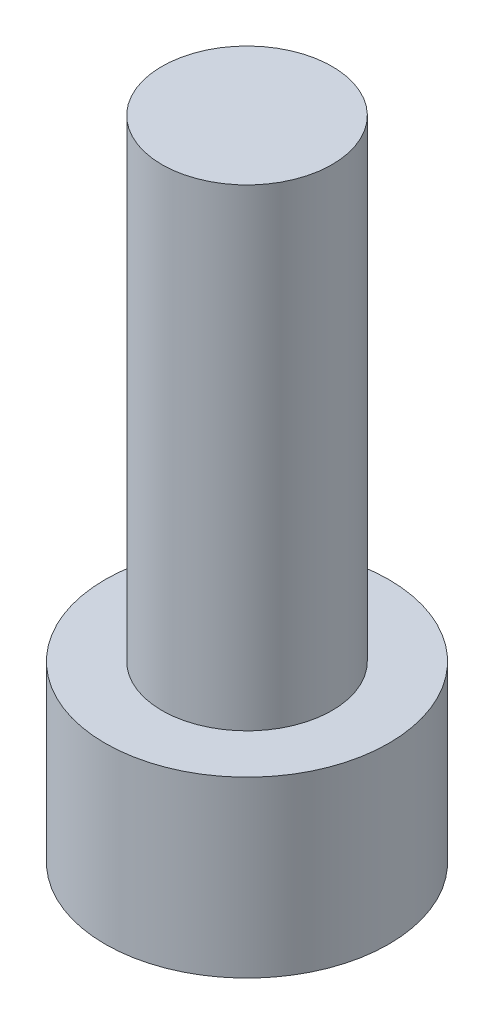
ISO-10303-21;
HEADER;
FILE_DESCRIPTION(('STEP AP214'),'2;1');
FILE_NAME('part.step','',(''),(''),'','','');
FILE_SCHEMA(('AUTOMOTIVE_DESIGN { 1 0 10303 214 1 1 1 1 }'));
ENDSEC;
DATA;
#1=APPLICATION_CONTEXT('core data for automotive mechanical design processes');
#2=APPLICATION_PROTOCOL_DEFINITION('international standard','automotive_design',2000,#1);
#3=PRODUCT_CONTEXT('',#1,'mechanical');
#4=PRODUCT('Part','Part','',(#3));
#5=PRODUCT_RELATED_PRODUCT_CATEGORY('part','',(#4));
#6=PRODUCT_DEFINITION_FORMATION('','',#4);
#7=PRODUCT_DEFINITION_CONTEXT('part definition',#1,'design');
#8=PRODUCT_DEFINITION('design','',#6,#7);
#9=PRODUCT_DEFINITION_SHAPE('','',#8);
#10=(LENGTH_UNIT() NAMED_UNIT(*) SI_UNIT(.MILLI.,.METRE.));
#11=(NAMED_UNIT(*) PLANE_ANGLE_UNIT() SI_UNIT($,.RADIAN.));
#12=(NAMED_UNIT(*) SI_UNIT($,.STERADIAN.) SOLID_ANGLE_UNIT());
#13=UNCERTAINTY_MEASURE_WITH_UNIT(LENGTH_MEASURE(1.E-05),#10,'distance_accuracy_value','');
#14=(GEOMETRIC_REPRESENTATION_CONTEXT(3) GLOBAL_UNCERTAINTY_ASSIGNED_CONTEXT((#13)) GLOBAL_UNIT_ASSIGNED_CONTEXT((#10,
#11,#12)) REPRESENTATION_CONTEXT('',''));
#15=CARTESIAN_POINT('',(0.,0.,0.));
#16=DIRECTION('',(0.,0.,1.));
#17=DIRECTION('',(1.,0.,0.));
#18=AXIS2_PLACEMENT_3D('',#15,#16,#17);
#19=CARTESIAN_POINT('',(0.,3.5052,0.));
#20=DIRECTION('',(0.,1.,0.));
#21=DIRECTION('',(0.,0.,1.));
#22=AXIS2_PLACEMENT_3D('',#19,#20,#21);
#23=PLANE('',#22);
#24=CARTESIAN_POINT('',(0.,3.5052,0.));
#25=DIRECTION('',(0.,1.,0.));
#26=DIRECTION('',(0.,0.,1.));
#27=AXIS2_PLACEMENT_3D('',#24,#25,#26);
#28=CIRCLE('',#27,2.8575);
#29=CARTESIAN_POINT('',(0.,3.5052,2.8575));
#30=VERTEX_POINT('',#29);
#31=EDGE_CURVE('E11',#30,#30,#28,.T.);
#32=ORIENTED_EDGE('',*,*,#31,.T.);
#33=EDGE_LOOP('',(#32));
#34=FACE_BOUND('',#33,.T.);
#35=CARTESIAN_POINT('',(0.,3.5052,0.));
#36=DIRECTION('',(0.,1.,0.));
#37=DIRECTION('',(0.,0.,1.));
#38=AXIS2_PLACEMENT_3D('',#35,#36,#37);
#39=CIRCLE('',#38,1.7145);
#40=CARTESIAN_POINT('',(0.,3.5052,1.7145));
#41=VERTEX_POINT('',#40);
#42=EDGE_CURVE('E152',#41,#41,#39,.T.);
#43=ORIENTED_EDGE('',*,*,#42,.F.);
#44=EDGE_LOOP('',(#43));
#45=FACE_BOUND('',#44,.T.);
#46=ADVANCED_FACE('F33',(#34,#45),#23,.T.);
#47=CARTESIAN_POINT('',(0.,3.5052,0.));
#48=DIRECTION('',(0.,-1.,0.));
#49=DIRECTION('',(0.,0.,-1.));
#50=AXIS2_PLACEMENT_3D('',#47,#48,#49);
#51=CYLINDRICAL_SURFACE('',#50,2.8575);
#52=ORIENTED_EDGE('',*,*,#31,.F.);
#53=EDGE_LOOP('',(#52));
#54=FACE_BOUND('',#53,.T.);
#55=CARTESIAN_POINT('',(0.,0.,0.));
#56=DIRECTION('',(0.,1.,0.));
#57=DIRECTION('',(0.,0.,1.));
#58=AXIS2_PLACEMENT_3D('',#55,#56,#57);
#59=CIRCLE('',#58,2.8575);
#60=CARTESIAN_POINT('',(0.,0.,2.8575));
#61=VERTEX_POINT('',#60);
#62=EDGE_CURVE('E37',#61,#61,#59,.T.);
#63=ORIENTED_EDGE('',*,*,#62,.T.);
#64=EDGE_LOOP('',(#63));
#65=FACE_BOUND('',#64,.T.);
#66=ADVANCED_FACE('F35',(#54,#65),#51,.T.);
#67=CARTESIAN_POINT('',(0.,0.,0.));
#68=DIRECTION('',(0.,1.,0.));
#69=DIRECTION('',(0.,0.,1.));
#70=AXIS2_PLACEMENT_3D('',#67,#68,#69);
#71=PLANE('',#70);
#72=DIRECTION('',(-0.500000000000001,0.,0.866025403784438));
#73=VECTOR('',#72,1.);
#74=CARTESIAN_POINT('',(1.60395121659243,0.,0.));
#75=LINE('',#74,#73);
#76=CARTESIAN_POINT('',(1.60395121659243,0.,0.));
#77=VERTEX_POINT('',#76);
#78=CARTESIAN_POINT('',(0.801975608296214,0.,1.3890625));
#79=VERTEX_POINT('',#78);
#80=EDGE_CURVE('E122',#77,#79,#75,.T.);
#81=ORIENTED_EDGE('',*,*,#80,.F.);
#82=DIRECTION('',(0.5,0.,0.866025403784439));
#83=VECTOR('',#82,1.);
#84=CARTESIAN_POINT('',(0.801975608296215,0.,-1.3890625));
#85=LINE('',#84,#83);
#86=CARTESIAN_POINT('',(0.801975608296215,0.,-1.3890625));
#87=VERTEX_POINT('',#86);
#88=EDGE_CURVE('E48',#87,#77,#85,.T.);
#89=ORIENTED_EDGE('',*,*,#88,.F.);
#90=DIRECTION('',(1.,0.,0.));
#91=VECTOR('',#90,1.);
#92=CARTESIAN_POINT('',(-0.801975608296214,0.,-1.3890625));
#93=LINE('',#92,#91);
#94=CARTESIAN_POINT('',(-0.801975608296214,0.,-1.3890625));
#95=VERTEX_POINT('',#94);
#96=EDGE_CURVE('E132',#95,#87,#93,.T.);
#97=ORIENTED_EDGE('',*,*,#96,.F.);
#98=DIRECTION('',(0.5,0.,-0.866025403784438));
#99=VECTOR('',#98,1.);
#100=CARTESIAN_POINT('',(-1.60395121659243,0.,0.));
#101=LINE('',#100,#99);
#102=CARTESIAN_POINT('',(-1.60395121659243,0.,0.));
#103=VERTEX_POINT('',#102);
#104=EDGE_CURVE('E130',#103,#95,#101,.T.);
#105=ORIENTED_EDGE('',*,*,#104,.F.);
#106=DIRECTION('',(-0.5,0.,-0.866025403784439));
#107=VECTOR('',#106,1.);
#108=CARTESIAN_POINT('',(-0.801975608296214,0.,1.3890625));
#109=LINE('',#108,#107);
#110=CARTESIAN_POINT('',(-0.801975608296214,0.,1.3890625));
#111=VERTEX_POINT('',#110);
#112=EDGE_CURVE('E96',#111,#103,#109,.T.);
#113=ORIENTED_EDGE('',*,*,#112,.F.);
#114=DIRECTION('',(-1.,0.,0.));
#115=VECTOR('',#114,1.);
#116=CARTESIAN_POINT('',(0.801975608296214,0.,1.3890625));
#117=LINE('',#116,#115);
#118=EDGE_CURVE('E126',#79,#111,#117,.T.);
#119=ORIENTED_EDGE('',*,*,#118,.F.);
#120=EDGE_LOOP('',(#81,#89,#97,#105,#113,#119));
#121=FACE_BOUND('',#120,.T.);
#122=ORIENTED_EDGE('',*,*,#62,.F.);
#123=EDGE_LOOP('',(#122));
#124=FACE_BOUND('',#123,.T.);
#125=ADVANCED_FACE('F145',(#121,#124),#71,.F.);
#126=CARTESIAN_POINT('',(0.801975608296215,1.9558,-1.3890625));
#127=DIRECTION('',(0.866025403784438,0.,-0.5));
#128=DIRECTION('',(-0.5,0.,-0.866025403784439));
#129=AXIS2_PLACEMENT_3D('',#126,#127,#128);
#130=PLANE('',#129);
#131=ORIENTED_EDGE('',*,*,#88,.T.);
#132=DIRECTION('',(0.,-1.,0.));
#133=VECTOR('',#132,1.);
#134=CARTESIAN_POINT('',(1.60395121659243,1.9558,0.));
#135=LINE('',#134,#133);
#136=CARTESIAN_POINT('',(1.60395121659243,1.9558,0.));
#137=VERTEX_POINT('',#136);
#138=EDGE_CURVE('E78',#137,#77,#135,.T.);
#139=ORIENTED_EDGE('',*,*,#138,.F.);
#140=DIRECTION('',(0.5,0.,0.866025403784439));
#141=VECTOR('',#140,1.);
#142=CARTESIAN_POINT('',(0.801975608296215,1.9558,-1.3890625));
#143=LINE('',#142,#141);
#144=CARTESIAN_POINT('',(0.801975608296215,1.9558,-1.3890625));
#145=VERTEX_POINT('',#144);
#146=EDGE_CURVE('E134',#145,#137,#143,.T.);
#147=ORIENTED_EDGE('',*,*,#146,.F.);
#148=DIRECTION('',(0.,-1.,0.));
#149=VECTOR('',#148,1.);
#150=CARTESIAN_POINT('',(0.801975608296215,1.9558,-1.3890625));
#151=LINE('',#150,#149);
#152=EDGE_CURVE('E56',#145,#87,#151,.T.);
#153=ORIENTED_EDGE('',*,*,#152,.T.);
#154=EDGE_LOOP('',(#131,#139,#147,#153));
#155=FACE_BOUND('',#154,.T.);
#156=ADVANCED_FACE('F174',(#155),#130,.F.);
#157=CARTESIAN_POINT('',(-0.801975608296214,1.9558,-1.3890625));
#158=DIRECTION('',(0.,0.,-1.));
#159=DIRECTION('',(-1.,0.,0.));
#160=AXIS2_PLACEMENT_3D('',#157,#158,#159);
#161=PLANE('',#160);
#162=ORIENTED_EDGE('',*,*,#96,.T.);
#163=ORIENTED_EDGE('',*,*,#152,.F.);
#164=DIRECTION('',(1.,0.,0.));
#165=VECTOR('',#164,1.);
#166=CARTESIAN_POINT('',(-0.801975608296214,1.9558,-1.3890625));
#167=LINE('',#166,#165);
#168=CARTESIAN_POINT('',(-0.801975608296214,1.9558,-1.3890625));
#169=VERTEX_POINT('',#168);
#170=EDGE_CURVE('E108',#169,#145,#167,.T.);
#171=ORIENTED_EDGE('',*,*,#170,.F.);
#172=DIRECTION('',(0.,-1.,0.));
#173=VECTOR('',#172,1.);
#174=CARTESIAN_POINT('',(-0.801975608296214,1.9558,-1.3890625));
#175=LINE('',#174,#173);
#176=EDGE_CURVE('E100',#169,#95,#175,.T.);
#177=ORIENTED_EDGE('',*,*,#176,.T.);
#178=EDGE_LOOP('',(#162,#163,#171,#177));
#179=FACE_BOUND('',#178,.T.);
#180=ADVANCED_FACE('F180',(#179),#161,.F.);
#181=CARTESIAN_POINT('',(-1.60395121659243,1.9558,0.));
#182=DIRECTION('',(-0.866025403784438,0.,-0.5));
#183=DIRECTION('',(-0.5,0.,0.866025403784439));
#184=AXIS2_PLACEMENT_3D('',#181,#182,#183);
#185=PLANE('',#184);
#186=ORIENTED_EDGE('',*,*,#104,.T.);
#187=ORIENTED_EDGE('',*,*,#176,.F.);
#188=DIRECTION('',(0.5,0.,-0.866025403784438));
#189=VECTOR('',#188,1.);
#190=CARTESIAN_POINT('',(-1.60395121659243,1.9558,0.));
#191=LINE('',#190,#189);
#192=CARTESIAN_POINT('',(-1.60395121659243,1.9558,0.));
#193=VERTEX_POINT('',#192);
#194=EDGE_CURVE('E104',#193,#169,#191,.T.);
#195=ORIENTED_EDGE('',*,*,#194,.F.);
#196=DIRECTION('',(0.,-1.,0.));
#197=VECTOR('',#196,1.);
#198=CARTESIAN_POINT('',(-1.60395121659243,1.9558,0.));
#199=LINE('',#198,#197);
#200=EDGE_CURVE('E89',#193,#103,#199,.T.);
#201=ORIENTED_EDGE('',*,*,#200,.T.);
#202=EDGE_LOOP('',(#186,#187,#195,#201));
#203=FACE_BOUND('',#202,.T.);
#204=ADVANCED_FACE('F105',(#203),#185,.F.);
#205=CARTESIAN_POINT('',(-0.801975608296214,1.9558,1.3890625));
#206=DIRECTION('',(-0.866025403784439,0.,0.5));
#207=DIRECTION('',(0.5,0.,0.866025403784439));
#208=AXIS2_PLACEMENT_3D('',#205,#206,#207);
#209=PLANE('',#208);
#210=ORIENTED_EDGE('',*,*,#112,.T.);
#211=ORIENTED_EDGE('',*,*,#200,.F.);
#212=DIRECTION('',(-0.5,0.,-0.866025403784439));
#213=VECTOR('',#212,1.);
#214=CARTESIAN_POINT('',(-0.801975608296214,1.9558,1.3890625));
#215=LINE('',#214,#213);
#216=CARTESIAN_POINT('',(-0.801975608296214,1.9558,1.3890625));
#217=VERTEX_POINT('',#216);
#218=EDGE_CURVE('E93',#217,#193,#215,.T.);
#219=ORIENTED_EDGE('',*,*,#218,.F.);
#220=DIRECTION('',(0.,-1.,0.));
#221=VECTOR('',#220,1.);
#222=CARTESIAN_POINT('',(-0.801975608296214,1.9558,1.3890625));
#223=LINE('',#222,#221);
#224=EDGE_CURVE('E101',#217,#111,#223,.T.);
#225=ORIENTED_EDGE('',*,*,#224,.T.);
#226=EDGE_LOOP('',(#210,#211,#219,#225));
#227=FACE_BOUND('',#226,.T.);
#228=ADVANCED_FACE('F91',(#227),#209,.F.);
#229=CARTESIAN_POINT('',(0.801975608296214,1.9558,1.3890625));
#230=DIRECTION('',(0.,0.,1.));
#231=DIRECTION('',(1.,0.,0.));
#232=AXIS2_PLACEMENT_3D('',#229,#230,#231);
#233=PLANE('',#232);
#234=ORIENTED_EDGE('',*,*,#118,.T.);
#235=ORIENTED_EDGE('',*,*,#224,.F.);
#236=DIRECTION('',(-1.,0.,0.));
#237=VECTOR('',#236,1.);
#238=CARTESIAN_POINT('',(0.801975608296214,1.9558,1.3890625));
#239=LINE('',#238,#237);
#240=CARTESIAN_POINT('',(0.801975608296214,1.9558,1.3890625));
#241=VERTEX_POINT('',#240);
#242=EDGE_CURVE('E114',#241,#217,#239,.T.);
#243=ORIENTED_EDGE('',*,*,#242,.F.);
#244=DIRECTION('',(0.,-1.,0.));
#245=VECTOR('',#244,1.);
#246=CARTESIAN_POINT('',(0.801975608296214,1.9558,1.3890625));
#247=LINE('',#246,#245);
#248=EDGE_CURVE('E138',#241,#79,#247,.T.);
#249=ORIENTED_EDGE('',*,*,#248,.T.);
#250=EDGE_LOOP('',(#234,#235,#243,#249));
#251=FACE_BOUND('',#250,.T.);
#252=ADVANCED_FACE('F149',(#251),#233,.F.);
#253=CARTESIAN_POINT('',(1.60395121659243,1.9558,0.));
#254=DIRECTION('',(0.866025403784438,0.,0.500000000000001));
#255=DIRECTION('',(0.500000000000001,0.,-0.866025403784438));
#256=AXIS2_PLACEMENT_3D('',#253,#254,#255);
#257=PLANE('',#256);
#258=ORIENTED_EDGE('',*,*,#80,.T.);
#259=ORIENTED_EDGE('',*,*,#248,.F.);
#260=DIRECTION('',(-0.500000000000001,0.,0.866025403784438));
#261=VECTOR('',#260,1.);
#262=CARTESIAN_POINT('',(1.60395121659243,1.9558,0.));
#263=LINE('',#262,#261);
#264=EDGE_CURVE('E116',#137,#241,#263,.T.);
#265=ORIENTED_EDGE('',*,*,#264,.F.);
#266=ORIENTED_EDGE('',*,*,#138,.T.);
#267=EDGE_LOOP('',(#258,#259,#265,#266));
#268=FACE_BOUND('',#267,.T.);
#269=ADVANCED_FACE('F142',(#268),#257,.F.);
#270=CARTESIAN_POINT('',(0.,1.9558,0.));
#271=DIRECTION('',(0.,-1.,0.));
#272=DIRECTION('',(0.,0.,-1.));
#273=AXIS2_PLACEMENT_3D('',#270,#271,#272);
#274=PLANE('',#273);
#275=ORIENTED_EDGE('',*,*,#146,.T.);
#276=ORIENTED_EDGE('',*,*,#264,.T.);
#277=ORIENTED_EDGE('',*,*,#242,.T.);
#278=ORIENTED_EDGE('',*,*,#218,.T.);
#279=ORIENTED_EDGE('',*,*,#194,.T.);
#280=ORIENTED_EDGE('',*,*,#170,.T.);
#281=EDGE_LOOP('',(#275,#276,#277,#278,#279,#280));
#282=FACE_BOUND('',#281,.T.);
#283=ADVANCED_FACE('F111',(#282),#274,.T.);
#284=CARTESIAN_POINT('',(0.,13.0302,0.));
#285=DIRECTION('',(0.,-1.,0.));
#286=DIRECTION('',(0.,0.,-1.));
#287=AXIS2_PLACEMENT_3D('',#284,#285,#286);
#288=CYLINDRICAL_SURFACE('',#287,1.7145);
#289=CARTESIAN_POINT('',(0.,13.0302,0.));
#290=DIRECTION('',(0.,1.,0.));
#291=DIRECTION('',(0.,0.,1.));
#292=AXIS2_PLACEMENT_3D('',#289,#290,#291);
#293=CIRCLE('',#292,1.7145);
#294=CARTESIAN_POINT('',(0.,13.0302,1.7145));
#295=VERTEX_POINT('',#294);
#296=EDGE_CURVE('E123',#295,#295,#293,.T.);
#297=ORIENTED_EDGE('',*,*,#296,.F.);
#298=EDGE_LOOP('',(#297));
#299=FACE_BOUND('',#298,.T.);
#300=ORIENTED_EDGE('',*,*,#42,.T.);
#301=EDGE_LOOP('',(#300));
#302=FACE_BOUND('',#301,.T.);
#303=ADVANCED_FACE('F160',(#299,#302),#288,.T.);
#304=CARTESIAN_POINT('',(0.,13.0302,0.));
#305=DIRECTION('',(0.,1.,0.));
#306=DIRECTION('',(0.,0.,1.));
#307=AXIS2_PLACEMENT_3D('',#304,#305,#306);
#308=PLANE('',#307);
#309=ORIENTED_EDGE('',*,*,#296,.T.);
#310=EDGE_LOOP('',(#309));
#311=FACE_BOUND('',#310,.T.);
#312=ADVANCED_FACE('F158',(#311),#308,.T.);
#313=CLOSED_SHELL('',(#46,#66,#125,#156,#180,#204,#228,#252,#269,#283,#303,#312));
#314=MANIFOLD_SOLID_BREP('B2',#313);
#315=ADVANCED_BREP_SHAPE_REPRESENTATION('',(#18,#314),#14);
#316=SHAPE_DEFINITION_REPRESENTATION(#9,#315);
ENDSEC;
END-ISO-10303-21;
